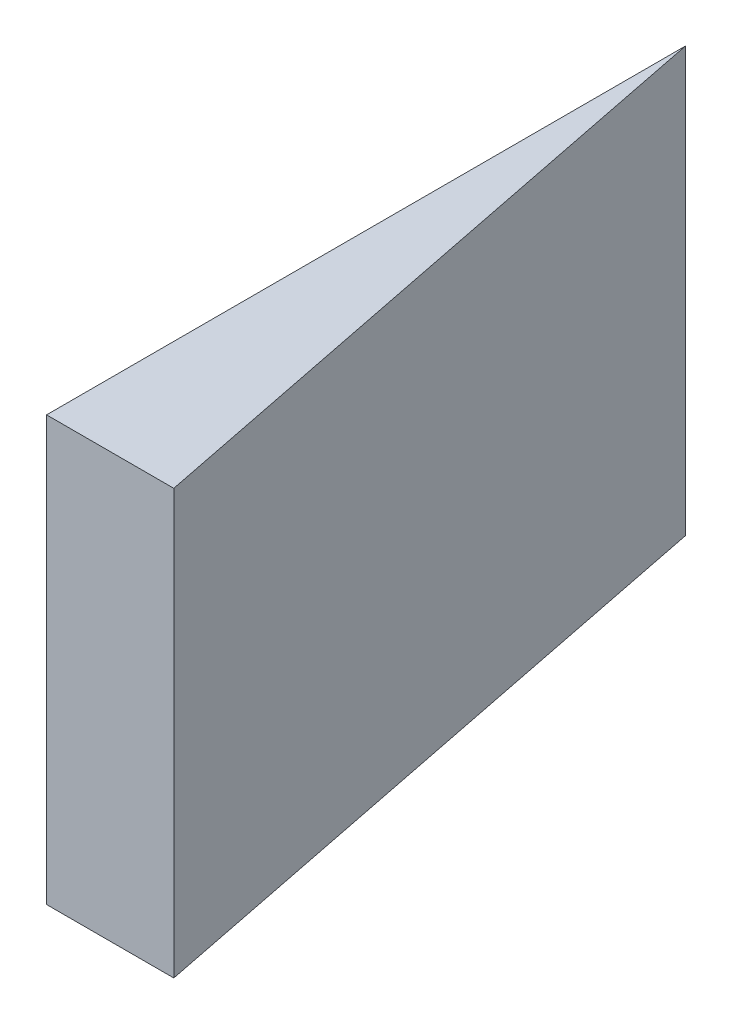
ISO-10303-21;
HEADER;
FILE_DESCRIPTION(('STEP AP214'),'2;1');
FILE_NAME('part.step','',(''),(''),'','','');
FILE_SCHEMA(('AUTOMOTIVE_DESIGN { 1 0 10303 214 1 1 1 1 }'));
ENDSEC;
DATA;
#1=APPLICATION_CONTEXT('core data for automotive mechanical design processes');
#2=APPLICATION_PROTOCOL_DEFINITION('international standard','automotive_design',2000,#1);
#3=PRODUCT_CONTEXT('',#1,'mechanical');
#4=PRODUCT('Part','Part','',(#3));
#5=PRODUCT_RELATED_PRODUCT_CATEGORY('part','',(#4));
#6=PRODUCT_DEFINITION_FORMATION('','',#4);
#7=PRODUCT_DEFINITION_CONTEXT('part definition',#1,'design');
#8=PRODUCT_DEFINITION('design','',#6,#7);
#9=PRODUCT_DEFINITION_SHAPE('','',#8);
#10=(LENGTH_UNIT() NAMED_UNIT(*) SI_UNIT(.MILLI.,.METRE.));
#11=(NAMED_UNIT(*) PLANE_ANGLE_UNIT() SI_UNIT($,.RADIAN.));
#12=(NAMED_UNIT(*) SI_UNIT($,.STERADIAN.) SOLID_ANGLE_UNIT());
#13=UNCERTAINTY_MEASURE_WITH_UNIT(LENGTH_MEASURE(1.E-05),#10,'distance_accuracy_value','');
#14=(GEOMETRIC_REPRESENTATION_CONTEXT(3) GLOBAL_UNCERTAINTY_ASSIGNED_CONTEXT((#13)) GLOBAL_UNIT_ASSIGNED_CONTEXT((#10,
#11,#12)) REPRESENTATION_CONTEXT('',''));
#15=CARTESIAN_POINT('',(0.,0.,0.));
#16=DIRECTION('',(0.,0.,1.));
#17=DIRECTION('',(1.,0.,0.));
#18=AXIS2_PLACEMENT_3D('',#15,#16,#17);
#19=CARTESIAN_POINT('',(3.37532170631,1.74999995469266,-5.23287720051423));
#20=DIRECTION('',(0.,1.,8.74227765734759E-08));
#21=DIRECTION('',(-1.,0.,0.));
#22=AXIS2_PLACEMENT_3D('',#19,#20,#21);
#23=PLANE('',#22);
#24=DIRECTION('',(-0.195310522456618,8.57391410123928E-08,-0.980741454114037));
#25=VECTOR('',#24,1.);
#26=CARTESIAN_POINT('',(3.3,1.74999981641117,-3.65112136800624));
#27=LINE('',#26,#25);
#28=CARTESIAN_POINT('',(3.3,1.74999981641017,-3.65112136800723));
#29=VERTEX_POINT('',#28);
#30=CARTESIAN_POINT('',(3.,1.74999994810682,-5.15755549420324));
#31=VERTEX_POINT('',#30);
#32=EDGE_CURVE('E11',#29,#31,#27,.T.);
#33=ORIENTED_EDGE('',*,*,#32,.T.);
#34=DIRECTION('',(0.,-8.74227765663743E-08,0.999999999999996));
#35=VECTOR('',#34,1.);
#36=CARTESIAN_POINT('',(3.,1.74999994810782,-5.15755549420423));
#37=LINE('',#36,#35);
#38=CARTESIAN_POINT('',(3.,1.74999981641017,-3.65112136800623));
#39=VERTEX_POINT('',#38);
#40=EDGE_CURVE('E49',#31,#39,#37,.T.);
#41=ORIENTED_EDGE('',*,*,#40,.T.);
#42=DIRECTION('',(1.,0.,0.));
#43=VECTOR('',#42,1.);
#44=CARTESIAN_POINT('',(3.,1.74999981641117,-3.65112136800623));
#45=LINE('',#44,#43);
#46=EDGE_CURVE('E47',#39,#29,#45,.T.);
#47=ORIENTED_EDGE('',*,*,#46,.T.);
#48=EDGE_LOOP('',(#33,#41,#47));
#49=FACE_BOUND('',#48,.T.);
#50=ADVANCED_FACE('F17',(#49),#23,.T.);
#51=CARTESIAN_POINT('',(3.37532170631,0.749999954692656,-5.23287728793701));
#52=DIRECTION('',(0.,1.,8.74227765734759E-08));
#53=DIRECTION('',(-1.,0.,0.));
#54=AXIS2_PLACEMENT_3D('',#51,#52,#53);
#55=PLANE('',#54);
#56=DIRECTION('',(1.,0.,0.));
#57=VECTOR('',#56,1.);
#58=CARTESIAN_POINT('',(3.,0.749999816411169,-3.65112145542901));
#59=LINE('',#58,#57);
#60=CARTESIAN_POINT('',(3.,0.749999816412169,-3.65112145542901));
#61=VERTEX_POINT('',#60);
#62=CARTESIAN_POINT('',(3.3,0.749999816412169,-3.65112145543001));
#63=VERTEX_POINT('',#62);
#64=EDGE_CURVE('E24',#61,#63,#59,.T.);
#65=ORIENTED_EDGE('',*,*,#64,.F.);
#66=DIRECTION('',(0.,-8.74227765663743E-08,0.999999999999996));
#67=VECTOR('',#66,1.);
#68=CARTESIAN_POINT('',(3.,0.749999948107823,-5.15755558162701));
#69=LINE('',#68,#67);
#70=CARTESIAN_POINT('',(3.,0.749999948108823,-5.15755558162601));
#71=VERTEX_POINT('',#70);
#72=EDGE_CURVE('E53',#71,#61,#69,.T.);
#73=ORIENTED_EDGE('',*,*,#72,.F.);
#74=DIRECTION('',(-0.195310522456618,8.57391410123929E-08,-0.980741454114037));
#75=VECTOR('',#74,1.);
#76=CARTESIAN_POINT('',(3.3,0.74999981641117,-3.65112145542901));
#77=LINE('',#76,#75);
#78=EDGE_CURVE('E68',#63,#71,#77,.T.);
#79=ORIENTED_EDGE('',*,*,#78,.F.);
#80=EDGE_LOOP('',(#65,#73,#79));
#81=FACE_BOUND('',#80,.T.);
#82=ADVANCED_FACE('F73',(#81),#55,.F.);
#83=CARTESIAN_POINT('',(3.3,1.74999981641117,-3.65112136800623));
#84=DIRECTION('',(-0.980741454114041,-1.70745881893227E-08,0.195310522456619));
#85=DIRECTION('',(-0.195310522456619,8.57391410193576E-08,-0.980741454114041));
#86=AXIS2_PLACEMENT_3D('',#83,#84,#85);
#87=PLANE('',#86);
#88=DIRECTION('',(0.,-0.999999999999996,-8.74227765734756E-08));
#89=VECTOR('',#88,1.);
#90=CARTESIAN_POINT('',(3.3,1.74999981641117,-3.65112136800623));
#91=LINE('',#90,#89);
#92=EDGE_CURVE('E59',#29,#63,#91,.T.);
#93=ORIENTED_EDGE('',*,*,#92,.T.);
#94=ORIENTED_EDGE('',*,*,#78,.T.);
#95=DIRECTION('',(0.,-0.999999999999996,-8.74227765734755E-08));
#96=VECTOR('',#95,1.);
#97=CARTESIAN_POINT('',(3.,1.74999994810782,-5.15755549420424));
#98=LINE('',#97,#96);
#99=EDGE_CURVE('E54',#31,#71,#98,.T.);
#100=ORIENTED_EDGE('',*,*,#99,.F.);
#101=ORIENTED_EDGE('',*,*,#32,.F.);
#102=EDGE_LOOP('',(#93,#94,#100,#101));
#103=FACE_BOUND('',#102,.T.);
#104=ADVANCED_FACE('F57',(#103),#87,.F.);
#105=CARTESIAN_POINT('',(3.,1.74999994810782,-5.15755549420424));
#106=DIRECTION('',(1.,0.,0.));
#107=DIRECTION('',(0.,-8.74227765734759E-08,1.));
#108=AXIS2_PLACEMENT_3D('',#105,#106,#107);
#109=PLANE('',#108);
#110=ORIENTED_EDGE('',*,*,#99,.T.);
#111=ORIENTED_EDGE('',*,*,#72,.T.);
#112=DIRECTION('',(0.,-0.999999999999996,-8.74227765734755E-08));
#113=VECTOR('',#112,1.);
#114=CARTESIAN_POINT('',(3.,1.74999981641117,-3.65112136800623));
#115=LINE('',#114,#113);
#116=EDGE_CURVE('E70',#39,#61,#115,.T.);
#117=ORIENTED_EDGE('',*,*,#116,.F.);
#118=ORIENTED_EDGE('',*,*,#40,.F.);
#119=EDGE_LOOP('',(#110,#111,#117,#118));
#120=FACE_BOUND('',#119,.T.);
#121=ADVANCED_FACE('F72',(#120),#109,.F.);
#122=CARTESIAN_POINT('',(3.,1.74999981641117,-3.65112136800623));
#123=DIRECTION('',(0.,8.74227765734759E-08,-1.));
#124=DIRECTION('',(1.,0.,0.));
#125=AXIS2_PLACEMENT_3D('',#122,#123,#124);
#126=PLANE('',#125);
#127=ORIENTED_EDGE('',*,*,#116,.T.);
#128=ORIENTED_EDGE('',*,*,#64,.T.);
#129=ORIENTED_EDGE('',*,*,#92,.F.);
#130=ORIENTED_EDGE('',*,*,#46,.F.);
#131=EDGE_LOOP('',(#127,#128,#129,#130));
#132=FACE_BOUND('',#131,.T.);
#133=ADVANCED_FACE('F61',(#132),#126,.F.);
#134=CLOSED_SHELL('',(#50,#82,#104,#121,#133));
#135=MANIFOLD_SOLID_BREP('B1',#134);
#136=ADVANCED_BREP_SHAPE_REPRESENTATION('',(#18,#135),#14);
#137=SHAPE_DEFINITION_REPRESENTATION(#9,#136);
ENDSEC;
END-ISO-10303-21;
